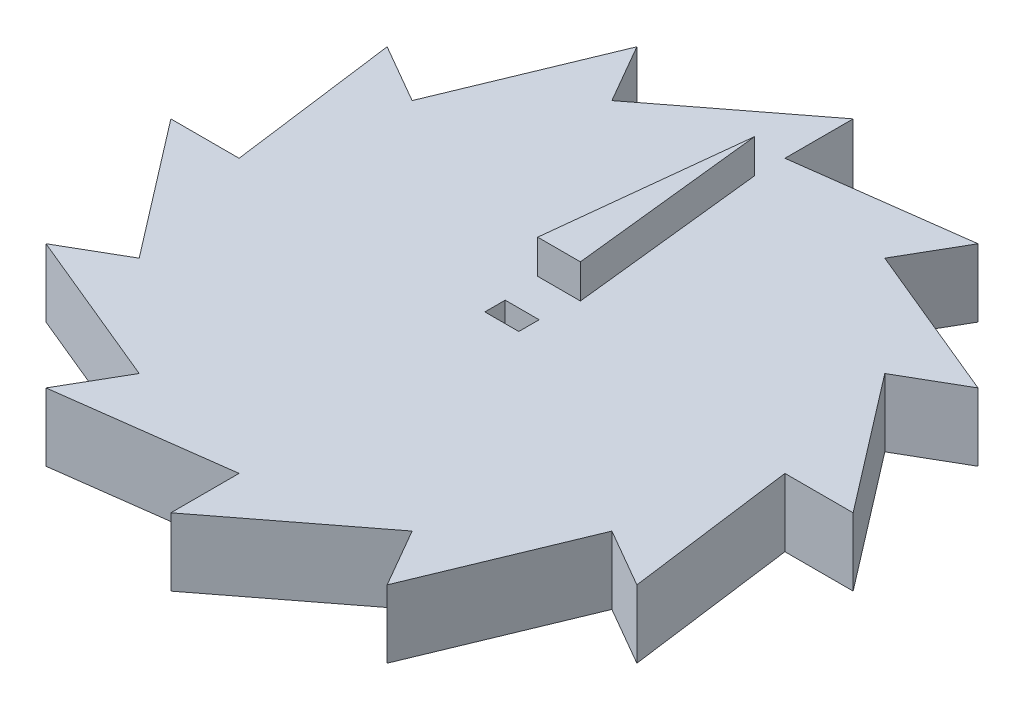
ISO-10303-21;
HEADER;
FILE_DESCRIPTION(('STEP AP214'),'2;1');
FILE_NAME('part.step','',(''),(''),'','','');
FILE_SCHEMA(('AUTOMOTIVE_DESIGN { 1 0 10303 214 1 1 1 1 }'));
ENDSEC;
DATA;
#1=APPLICATION_CONTEXT('core data for automotive mechanical design processes');
#2=APPLICATION_PROTOCOL_DEFINITION('international standard','automotive_design',2000,#1);
#3=PRODUCT_CONTEXT('',#1,'mechanical');
#4=PRODUCT('Part','Part','',(#3));
#5=PRODUCT_RELATED_PRODUCT_CATEGORY('part','',(#4));
#6=PRODUCT_DEFINITION_FORMATION('','',#4);
#7=PRODUCT_DEFINITION_CONTEXT('part definition',#1,'design');
#8=PRODUCT_DEFINITION('design','',#6,#7);
#9=PRODUCT_DEFINITION_SHAPE('','',#8);
#10=(LENGTH_UNIT() NAMED_UNIT(*) SI_UNIT(.MILLI.,.METRE.));
#11=(NAMED_UNIT(*) PLANE_ANGLE_UNIT() SI_UNIT($,.RADIAN.));
#12=(NAMED_UNIT(*) SI_UNIT($,.STERADIAN.) SOLID_ANGLE_UNIT());
#13=UNCERTAINTY_MEASURE_WITH_UNIT(LENGTH_MEASURE(1.E-05),#10,'distance_accuracy_value','');
#14=(GEOMETRIC_REPRESENTATION_CONTEXT(3) GLOBAL_UNCERTAINTY_ASSIGNED_CONTEXT((#13)) GLOBAL_UNIT_ASSIGNED_CONTEXT((#10,
#11,#12)) REPRESENTATION_CONTEXT('',''));
#15=CARTESIAN_POINT('',(0.,0.,0.));
#16=DIRECTION('',(0.,0.,1.));
#17=DIRECTION('',(1.,0.,0.));
#18=AXIS2_PLACEMENT_3D('',#15,#16,#17);
#19=CARTESIAN_POINT('',(0.,10.,0.));
#20=DIRECTION('',(0.,1.,0.));
#21=DIRECTION('',(0.,0.,1.));
#22=AXIS2_PLACEMENT_3D('',#19,#20,#21);
#23=PLANE('',#22);
#24=DIRECTION('',(1.,0.,0.));
#25=VECTOR('',#24,1.);
#26=CARTESIAN_POINT('',(-2.5,10.,1.5));
#27=LINE('',#26,#25);
#28=CARTESIAN_POINT('',(-2.5,10.,1.5));
#29=VERTEX_POINT('',#28);
#30=CARTESIAN_POINT('',(2.5,10.,1.5));
#31=VERTEX_POINT('',#30);
#32=EDGE_CURVE('E267',#29,#31,#27,.T.);
#33=ORIENTED_EDGE('',*,*,#32,.F.);
#34=DIRECTION('',(0.,0.,1.));
#35=VECTOR('',#34,1.);
#36=CARTESIAN_POINT('',(-2.5,10.,-1.5));
#37=LINE('',#36,#35);
#38=CARTESIAN_POINT('',(-2.5,10.,-1.5));
#39=VERTEX_POINT('',#38);
#40=EDGE_CURVE('E265',#39,#29,#37,.T.);
#41=ORIENTED_EDGE('',*,*,#40,.F.);
#42=DIRECTION('',(-1.,0.,0.));
#43=VECTOR('',#42,1.);
#44=CARTESIAN_POINT('',(-2.5,10.,-1.5));
#45=LINE('',#44,#43);
#46=CARTESIAN_POINT('',(2.5,10.,-1.5));
#47=VERTEX_POINT('',#46);
#48=EDGE_CURVE('E272',#47,#39,#45,.T.);
#49=ORIENTED_EDGE('',*,*,#48,.F.);
#50=DIRECTION('',(0.,0.,-1.));
#51=VECTOR('',#50,1.);
#52=CARTESIAN_POINT('',(2.5,10.,-1.5));
#53=LINE('',#52,#51);
#54=EDGE_CURVE('E270',#31,#47,#53,.T.);
#55=ORIENTED_EDGE('',*,*,#54,.F.);
#56=EDGE_LOOP('',(#33,#41,#49,#55));
#57=FACE_BOUND('',#56,.T.);
#58=DIRECTION('',(-0.991393683900797,0.,0.130914336577806));
#59=VECTOR('',#58,1.);
#60=CARTESIAN_POINT('',(25.1396416291331,10.,-43.5431365857308));
#61=LINE('',#60,#59);
#62=CARTESIAN_POINT('',(25.1396416291331,10.,-43.5431365857308));
#63=VERTEX_POINT('',#62);
#64=CARTESIAN_POINT('',(0.,10.,-40.223426606611));
#65=VERTEX_POINT('',#64);
#66=EDGE_CURVE('E291',#63,#65,#61,.T.);
#67=ORIENTED_EDGE('',*,*,#66,.T.);
#68=DIRECTION('',(0.,0.,-1.));
#69=VECTOR('',#68,1.);
#70=CARTESIAN_POINT('',(0.,10.,-40.223426606611));
#71=LINE('',#70,#69);
#72=CARTESIAN_POINT('',(0.,10.,-50.2792832582638));
#73=VERTEX_POINT('',#72);
#74=EDGE_CURVE('E294',#65,#73,#71,.T.);
#75=ORIENTED_EDGE('',*,*,#74,.T.);
#76=DIRECTION('',(-0.793114947120626,0.,0.609071983146365));
#77=VECTOR('',#76,1.);
#78=CARTESIAN_POINT('',(0.,10.,-50.2792832582638));
#79=LINE('',#78,#77);
#80=CARTESIAN_POINT('',(-20.1117133033062,10.,-34.8345092685828));
#81=VERTEX_POINT('',#80);
#82=EDGE_CURVE('E297',#73,#81,#79,.T.);
#83=ORIENTED_EDGE('',*,*,#82,.T.);
#84=DIRECTION('',(-0.5,0.,-0.866025403784438));
#85=VECTOR('',#84,1.);
#86=CARTESIAN_POINT('',(-20.1117133033062,10.,-34.8345092685828));
#87=LINE('',#86,#85);
#88=CARTESIAN_POINT('',(-25.1396416291326,10.,-43.5431365857288));
#89=VERTEX_POINT('',#88);
#90=EDGE_CURVE('E299',#81,#89,#87,.T.);
#91=ORIENTED_EDGE('',*,*,#90,.T.);
#92=DIRECTION('',(-0.382321700754425,0.,0.924029283698436));
#93=VECTOR('',#92,1.);
#94=CARTESIAN_POINT('',(-25.1396416291326,10.,-43.5431365857288));
#95=LINE('',#94,#93);
#96=CARTESIAN_POINT('',(-34.8345092685852,10.,-20.1117133033014));
#97=VERTEX_POINT('',#96);
#98=EDGE_CURVE('E301',#89,#97,#95,.T.);
#99=ORIENTED_EDGE('',*,*,#98,.T.);
#100=DIRECTION('',(-0.866025403784439,0.,-0.5));
#101=VECTOR('',#100,1.);
#102=CARTESIAN_POINT('',(-34.8345092685852,10.,-20.1117133033014));
#103=LINE('',#102,#101);
#104=CARTESIAN_POINT('',(-43.5431365857312,10.,-25.1396416291278));
#105=VERTEX_POINT('',#104);
#106=EDGE_CURVE('E303',#97,#105,#103,.T.);
#107=ORIENTED_EDGE('',*,*,#106,.T.);
#108=DIRECTION('',(0.130914336577818,0.,0.991393683900795));
#109=VECTOR('',#108,1.);
#110=CARTESIAN_POINT('',(-43.5431365857312,10.,-25.1396416291278));
#111=LINE('',#110,#109);
#112=CARTESIAN_POINT('',(-40.223426606611,10.,5.94927846668505E-12));
#113=VERTEX_POINT('',#112);
#114=EDGE_CURVE('E305',#105,#113,#111,.T.);
#115=ORIENTED_EDGE('',*,*,#114,.T.);
#116=DIRECTION('',(-1.,0.,0.));
#117=VECTOR('',#116,1.);
#118=CARTESIAN_POINT('',(-40.223426606611,10.,5.94927846668505E-12));
#119=LINE('',#118,#117);
#120=CARTESIAN_POINT('',(-50.2792832582638,10.,5.94927846668505E-12));
#121=VERTEX_POINT('',#120);
#122=EDGE_CURVE('E307',#113,#121,#119,.T.);
#123=ORIENTED_EDGE('',*,*,#122,.T.);
#124=DIRECTION('',(0.609071983146374,0.,0.793114947120619));
#125=VECTOR('',#124,1.);
#126=CARTESIAN_POINT('',(-50.2792832582638,10.,5.94927846668505E-12));
#127=LINE('',#126,#125);
#128=CARTESIAN_POINT('',(-34.8345092685822,10.,20.1117133033126));
#129=VERTEX_POINT('',#128);
#130=EDGE_CURVE('E309',#121,#129,#127,.T.);
#131=ORIENTED_EDGE('',*,*,#130,.T.);
#132=DIRECTION('',(-0.866025403784438,0.,0.500000000000001));
#133=VECTOR('',#132,1.);
#134=CARTESIAN_POINT('',(-34.8345092685822,10.,20.1117133033126));
#135=LINE('',#134,#133);
#136=CARTESIAN_POINT('',(-43.5431365857282,10.,25.1396416291389));
#137=VERTEX_POINT('',#136);
#138=EDGE_CURVE('E311',#129,#137,#135,.T.);
#139=ORIENTED_EDGE('',*,*,#138,.T.);
#140=DIRECTION('',(0.924029283698437,0.,0.382321700754421));
#141=VECTOR('',#140,1.);
#142=CARTESIAN_POINT('',(-43.5431365857282,10.,25.1396416291389));
#143=LINE('',#142,#141);
#144=CARTESIAN_POINT('',(-20.1117133033014,10.,34.8345092685911));
#145=VERTEX_POINT('',#144);
#146=EDGE_CURVE('E313',#137,#145,#143,.T.);
#147=ORIENTED_EDGE('',*,*,#146,.T.);
#148=DIRECTION('',(-0.499999999999999,0.,0.866025403784439));
#149=VECTOR('',#148,1.);
#150=CARTESIAN_POINT('',(-20.1117133033014,10.,34.8345092685911));
#151=LINE('',#150,#149);
#152=CARTESIAN_POINT('',(-25.1396416291278,10.,43.5431365857371));
#153=VERTEX_POINT('',#152);
#154=EDGE_CURVE('E315',#145,#153,#151,.T.);
#155=ORIENTED_EDGE('',*,*,#154,.T.);
#156=DIRECTION('',(0.991393683900795,0.,-0.130914336577818));
#157=VECTOR('',#156,1.);
#158=CARTESIAN_POINT('',(-25.1396416291278,10.,43.5431365857371));
#159=LINE('',#158,#157);
#160=CARTESIAN_POINT('',(5.9537931443947E-12,10.,40.223426606617));
#161=VERTEX_POINT('',#160);
#162=EDGE_CURVE('E317',#153,#161,#159,.T.);
#163=ORIENTED_EDGE('',*,*,#162,.T.);
#164=DIRECTION('',(0.,0.,1.));
#165=VECTOR('',#164,1.);
#166=CARTESIAN_POINT('',(5.9537931443947E-12,10.,40.223426606617));
#167=LINE('',#166,#165);
#168=CARTESIAN_POINT('',(5.95317740076164E-12,10.,50.2792832582697));
#169=VERTEX_POINT('',#168);
#170=EDGE_CURVE('E319',#161,#169,#167,.T.);
#171=ORIENTED_EDGE('',*,*,#170,.T.);
#172=DIRECTION('',(0.79311494712062,0.,-0.609071983146374));
#173=VECTOR('',#172,1.);
#174=CARTESIAN_POINT('',(5.95317740076164E-12,10.,50.2792832582697));
#175=LINE('',#174,#173);
#176=CARTESIAN_POINT('',(20.1117133033126,10.,34.8345092685881));
#177=VERTEX_POINT('',#176);
#178=EDGE_CURVE('E321',#169,#177,#175,.T.);
#179=ORIENTED_EDGE('',*,*,#178,.T.);
#180=DIRECTION('',(0.5,0.,0.866025403784438));
#181=VECTOR('',#180,1.);
#182=CARTESIAN_POINT('',(20.1117133033126,10.,34.8345092685881));
#183=LINE('',#182,#181);
#184=CARTESIAN_POINT('',(25.139641629139,10.,43.5431365857341));
#185=VERTEX_POINT('',#184);
#186=EDGE_CURVE('E323',#177,#185,#183,.T.);
#187=ORIENTED_EDGE('',*,*,#186,.T.);
#188=DIRECTION('',(0.382321700754421,0.,-0.924029283698437));
#189=VECTOR('',#188,1.);
#190=CARTESIAN_POINT('',(25.139641629139,10.,43.5431365857341));
#191=LINE('',#190,#189);
#192=CARTESIAN_POINT('',(34.8345092685911,10.,20.1117133033074));
#193=VERTEX_POINT('',#192);
#194=EDGE_CURVE('E325',#185,#193,#191,.T.);
#195=ORIENTED_EDGE('',*,*,#194,.T.);
#196=DIRECTION('',(0.866025403784439,0.,0.5));
#197=VECTOR('',#196,1.);
#198=CARTESIAN_POINT('',(34.8345092685911,10.,20.1117133033074));
#199=LINE('',#198,#197);
#200=CARTESIAN_POINT('',(43.5431365857371,10.,25.1396416291338));
#201=VERTEX_POINT('',#200);
#202=EDGE_CURVE('E327',#193,#201,#199,.T.);
#203=ORIENTED_EDGE('',*,*,#202,.T.);
#204=DIRECTION('',(-0.130914336577818,0.,-0.991393683900795));
#205=VECTOR('',#204,1.);
#206=CARTESIAN_POINT('',(43.5431365857371,10.,25.1396416291338));
#207=LINE('',#206,#205);
#208=CARTESIAN_POINT('',(40.223426606617,10.,0.));
#209=VERTEX_POINT('',#208);
#210=EDGE_CURVE('E329',#201,#209,#207,.T.);
#211=ORIENTED_EDGE('',*,*,#210,.T.);
#212=DIRECTION('',(1.,0.,0.));
#213=VECTOR('',#212,1.);
#214=CARTESIAN_POINT('',(40.223426606617,10.,0.));
#215=LINE('',#214,#213);
#216=CARTESIAN_POINT('',(50.2792832582698,10.,0.));
#217=VERTEX_POINT('',#216);
#218=EDGE_CURVE('E331',#209,#217,#215,.T.);
#219=ORIENTED_EDGE('',*,*,#218,.T.);
#220=DIRECTION('',(-0.609071983146374,0.,-0.79311494712062));
#221=VECTOR('',#220,1.);
#222=CARTESIAN_POINT('',(50.2792832582698,10.,0.));
#223=LINE('',#222,#221);
#224=CARTESIAN_POINT('',(34.8345092685881,10.,-20.1117133033066));
#225=VERTEX_POINT('',#224);
#226=EDGE_CURVE('E333',#217,#225,#223,.T.);
#227=ORIENTED_EDGE('',*,*,#226,.T.);
#228=DIRECTION('',(0.866025403784439,0.,-0.5));
#229=VECTOR('',#228,1.);
#230=CARTESIAN_POINT('',(34.8345092685881,10.,-20.1117133033066));
#231=LINE('',#230,#229);
#232=CARTESIAN_POINT('',(43.5431365857341,10.,-25.139641629133));
#233=VERTEX_POINT('',#232);
#234=EDGE_CURVE('E335',#225,#233,#231,.T.);
#235=ORIENTED_EDGE('',*,*,#234,.T.);
#236=DIRECTION('',(-0.924029283698446,0.,-0.382321700754399));
#237=VECTOR('',#236,1.);
#238=CARTESIAN_POINT('',(43.5431365857341,10.,-25.139641629133));
#239=LINE('',#238,#237);
#240=CARTESIAN_POINT('',(20.1117133033068,10.,-34.8345092685848));
#241=VERTEX_POINT('',#240);
#242=EDGE_CURVE('E337',#233,#241,#239,.T.);
#243=ORIENTED_EDGE('',*,*,#242,.T.);
#244=DIRECTION('',(0.5,0.,-0.866025403784439));
#245=VECTOR('',#244,1.);
#246=CARTESIAN_POINT('',(20.1117133033068,10.,-34.8345092685848));
#247=LINE('',#246,#245);
#248=EDGE_CURVE('E339',#241,#63,#247,.T.);
#249=ORIENTED_EDGE('',*,*,#248,.T.);
#250=EDGE_LOOP('',(#67,#75,#83,#91,#99,#107,#115,#123,#131,#139,#147,#155,#163,#171,#179,#187,
#195,#203,#211,#219,#227,#235,#243,#249));
#251=FACE_BOUND('',#250,.T.);
#252=DIRECTION('',(-0.108620689655172,0.,0.994083269036772));
#253=VECTOR('',#252,1.);
#254=CARTESIAN_POINT('',(0.,10.,-35.7618612088923));
#255=LINE('',#254,#253);
#256=CARTESIAN_POINT('',(0.,10.,-35.7618612088923));
#257=VERTEX_POINT('',#256);
#258=CARTESIAN_POINT('',(-3.15000000000001,10.,-6.93344640682597));
#259=VERTEX_POINT('',#258);
#260=EDGE_CURVE('E857',#257,#259,#255,.T.);
#261=ORIENTED_EDGE('',*,*,#260,.F.);
#262=DIRECTION('',(-0.108620689655173,0.,-0.994083269036772));
#263=VECTOR('',#262,1.);
#264=CARTESIAN_POINT('',(0.,10.,-35.7618612088923));
#265=LINE('',#264,#263);
#266=CARTESIAN_POINT('',(3.14999999999999,10.,-6.93344640682597));
#267=VERTEX_POINT('',#266);
#268=EDGE_CURVE('E254',#267,#257,#265,.T.);
#269=ORIENTED_EDGE('',*,*,#268,.F.);
#270=DIRECTION('',(1.,0.,0.));
#271=VECTOR('',#270,1.);
#272=CARTESIAN_POINT('',(3.14999999999999,10.,-6.93344640682597));
#273=LINE('',#272,#271);
#274=EDGE_CURVE('E250',#259,#267,#273,.T.);
#275=ORIENTED_EDGE('',*,*,#274,.F.);
#276=EDGE_LOOP('',(#261,#269,#275));
#277=FACE_BOUND('',#276,.T.);
#278=ADVANCED_FACE('F33',(#57,#251,#277),#23,.T.);
#279=CARTESIAN_POINT('',(0.,0.,0.));
#280=DIRECTION('',(0.,1.,0.));
#281=DIRECTION('',(0.,0.,1.));
#282=AXIS2_PLACEMENT_3D('',#279,#280,#281);
#283=PLANE('',#282);
#284=DIRECTION('',(-0.991393683900797,0.,0.130914336577806));
#285=VECTOR('',#284,1.);
#286=CARTESIAN_POINT('',(25.1396416291331,0.,-43.5431365857308));
#287=LINE('',#286,#285);
#288=CARTESIAN_POINT('',(25.1396416291331,0.,-43.5431365857308));
#289=VERTEX_POINT('',#288);
#290=CARTESIAN_POINT('',(0.,0.,-40.223426606611));
#291=VERTEX_POINT('',#290);
#292=EDGE_CURVE('E290',#289,#291,#287,.T.);
#293=ORIENTED_EDGE('',*,*,#292,.F.);
#294=DIRECTION('',(0.5,0.,-0.866025403784439));
#295=VECTOR('',#294,1.);
#296=CARTESIAN_POINT('',(20.1117133033068,0.,-34.8345092685848));
#297=LINE('',#296,#295);
#298=CARTESIAN_POINT('',(20.1117133033068,0.,-34.8345092685848));
#299=VERTEX_POINT('',#298);
#300=EDGE_CURVE('E295',#299,#289,#297,.T.);
#301=ORIENTED_EDGE('',*,*,#300,.F.);
#302=DIRECTION('',(-0.924029283698446,0.,-0.382321700754399));
#303=VECTOR('',#302,1.);
#304=CARTESIAN_POINT('',(43.5431365857341,0.,-25.139641629133));
#305=LINE('',#304,#303);
#306=CARTESIAN_POINT('',(43.5431365857341,0.,-25.139641629133));
#307=VERTEX_POINT('',#306);
#308=EDGE_CURVE('E386',#307,#299,#305,.T.);
#309=ORIENTED_EDGE('',*,*,#308,.F.);
#310=DIRECTION('',(0.866025403784439,0.,-0.5));
#311=VECTOR('',#310,1.);
#312=CARTESIAN_POINT('',(34.8345092685881,0.,-20.1117133033066));
#313=LINE('',#312,#311);
#314=CARTESIAN_POINT('',(34.8345092685881,0.,-20.1117133033066));
#315=VERTEX_POINT('',#314);
#316=EDGE_CURVE('E384',#315,#307,#313,.T.);
#317=ORIENTED_EDGE('',*,*,#316,.F.);
#318=DIRECTION('',(-0.609071983146374,0.,-0.79311494712062));
#319=VECTOR('',#318,1.);
#320=CARTESIAN_POINT('',(50.2792832582698,0.,0.));
#321=LINE('',#320,#319);
#322=CARTESIAN_POINT('',(50.2792832582698,0.,0.));
#323=VERTEX_POINT('',#322);
#324=EDGE_CURVE('E382',#323,#315,#321,.T.);
#325=ORIENTED_EDGE('',*,*,#324,.F.);
#326=DIRECTION('',(1.,0.,0.));
#327=VECTOR('',#326,1.);
#328=CARTESIAN_POINT('',(40.223426606617,0.,0.));
#329=LINE('',#328,#327);
#330=CARTESIAN_POINT('',(40.223426606617,0.,0.));
#331=VERTEX_POINT('',#330);
#332=EDGE_CURVE('E380',#331,#323,#329,.T.);
#333=ORIENTED_EDGE('',*,*,#332,.F.);
#334=DIRECTION('',(-0.130914336577818,0.,-0.991393683900795));
#335=VECTOR('',#334,1.);
#336=CARTESIAN_POINT('',(43.5431365857371,0.,25.1396416291338));
#337=LINE('',#336,#335);
#338=CARTESIAN_POINT('',(43.5431365857371,0.,25.1396416291338));
#339=VERTEX_POINT('',#338);
#340=EDGE_CURVE('E378',#339,#331,#337,.T.);
#341=ORIENTED_EDGE('',*,*,#340,.F.);
#342=DIRECTION('',(0.866025403784439,0.,0.5));
#343=VECTOR('',#342,1.);
#344=CARTESIAN_POINT('',(34.8345092685911,0.,20.1117133033074));
#345=LINE('',#344,#343);
#346=CARTESIAN_POINT('',(34.8345092685911,0.,20.1117133033074));
#347=VERTEX_POINT('',#346);
#348=EDGE_CURVE('E376',#347,#339,#345,.T.);
#349=ORIENTED_EDGE('',*,*,#348,.F.);
#350=DIRECTION('',(0.382321700754421,0.,-0.924029283698437));
#351=VECTOR('',#350,1.);
#352=CARTESIAN_POINT('',(25.139641629139,0.,43.5431365857341));
#353=LINE('',#352,#351);
#354=CARTESIAN_POINT('',(25.139641629139,0.,43.5431365857341));
#355=VERTEX_POINT('',#354);
#356=EDGE_CURVE('E374',#355,#347,#353,.T.);
#357=ORIENTED_EDGE('',*,*,#356,.F.);
#358=DIRECTION('',(0.5,0.,0.866025403784438));
#359=VECTOR('',#358,1.);
#360=CARTESIAN_POINT('',(20.1117133033126,0.,34.8345092685881));
#361=LINE('',#360,#359);
#362=CARTESIAN_POINT('',(20.1117133033126,0.,34.8345092685881));
#363=VERTEX_POINT('',#362);
#364=EDGE_CURVE('E372',#363,#355,#361,.T.);
#365=ORIENTED_EDGE('',*,*,#364,.F.);
#366=DIRECTION('',(0.79311494712062,0.,-0.609071983146374));
#367=VECTOR('',#366,1.);
#368=CARTESIAN_POINT('',(5.95317740076164E-12,0.,50.2792832582697));
#369=LINE('',#368,#367);
#370=CARTESIAN_POINT('',(5.95317740076164E-12,0.,50.2792832582697));
#371=VERTEX_POINT('',#370);
#372=EDGE_CURVE('E370',#371,#363,#369,.T.);
#373=ORIENTED_EDGE('',*,*,#372,.F.);
#374=DIRECTION('',(0.,0.,1.));
#375=VECTOR('',#374,1.);
#376=CARTESIAN_POINT('',(5.9537931443947E-12,0.,40.223426606617));
#377=LINE('',#376,#375);
#378=CARTESIAN_POINT('',(5.9537931443947E-12,0.,40.223426606617));
#379=VERTEX_POINT('',#378);
#380=EDGE_CURVE('E368',#379,#371,#377,.T.);
#381=ORIENTED_EDGE('',*,*,#380,.F.);
#382=DIRECTION('',(0.991393683900795,0.,-0.130914336577818));
#383=VECTOR('',#382,1.);
#384=CARTESIAN_POINT('',(-25.1396416291278,0.,43.5431365857371));
#385=LINE('',#384,#383);
#386=CARTESIAN_POINT('',(-25.1396416291278,0.,43.5431365857371));
#387=VERTEX_POINT('',#386);
#388=EDGE_CURVE('E366',#387,#379,#385,.T.);
#389=ORIENTED_EDGE('',*,*,#388,.F.);
#390=DIRECTION('',(-0.499999999999999,0.,0.866025403784439));
#391=VECTOR('',#390,1.);
#392=CARTESIAN_POINT('',(-20.1117133033014,0.,34.8345092685911));
#393=LINE('',#392,#391);
#394=CARTESIAN_POINT('',(-20.1117133033014,0.,34.8345092685911));
#395=VERTEX_POINT('',#394);
#396=EDGE_CURVE('E364',#395,#387,#393,.T.);
#397=ORIENTED_EDGE('',*,*,#396,.F.);
#398=DIRECTION('',(0.924029283698437,0.,0.382321700754421));
#399=VECTOR('',#398,1.);
#400=CARTESIAN_POINT('',(-43.5431365857282,0.,25.1396416291389));
#401=LINE('',#400,#399);
#402=CARTESIAN_POINT('',(-43.5431365857282,0.,25.1396416291389));
#403=VERTEX_POINT('',#402);
#404=EDGE_CURVE('E362',#403,#395,#401,.T.);
#405=ORIENTED_EDGE('',*,*,#404,.F.);
#406=DIRECTION('',(-0.866025403784438,0.,0.500000000000001));
#407=VECTOR('',#406,1.);
#408=CARTESIAN_POINT('',(-34.8345092685822,0.,20.1117133033126));
#409=LINE('',#408,#407);
#410=CARTESIAN_POINT('',(-34.8345092685822,0.,20.1117133033126));
#411=VERTEX_POINT('',#410);
#412=EDGE_CURVE('E360',#411,#403,#409,.T.);
#413=ORIENTED_EDGE('',*,*,#412,.F.);
#414=DIRECTION('',(0.609071983146374,0.,0.793114947120619));
#415=VECTOR('',#414,1.);
#416=CARTESIAN_POINT('',(-50.2792832582638,0.,5.94927846668505E-12));
#417=LINE('',#416,#415);
#418=CARTESIAN_POINT('',(-50.2792832582638,0.,5.94927846668505E-12));
#419=VERTEX_POINT('',#418);
#420=EDGE_CURVE('E358',#419,#411,#417,.T.);
#421=ORIENTED_EDGE('',*,*,#420,.F.);
#422=DIRECTION('',(-1.,0.,0.));
#423=VECTOR('',#422,1.);
#424=CARTESIAN_POINT('',(-40.223426606611,0.,5.94927846668505E-12));
#425=LINE('',#424,#423);
#426=CARTESIAN_POINT('',(-40.223426606611,0.,5.94927846668505E-12));
#427=VERTEX_POINT('',#426);
#428=EDGE_CURVE('E356',#427,#419,#425,.T.);
#429=ORIENTED_EDGE('',*,*,#428,.F.);
#430=DIRECTION('',(0.130914336577818,0.,0.991393683900795));
#431=VECTOR('',#430,1.);
#432=CARTESIAN_POINT('',(-43.5431365857312,0.,-25.1396416291278));
#433=LINE('',#432,#431);
#434=CARTESIAN_POINT('',(-43.5431365857312,0.,-25.1396416291278));
#435=VERTEX_POINT('',#434);
#436=EDGE_CURVE('E354',#435,#427,#433,.T.);
#437=ORIENTED_EDGE('',*,*,#436,.F.);
#438=DIRECTION('',(-0.866025403784439,0.,-0.5));
#439=VECTOR('',#438,1.);
#440=CARTESIAN_POINT('',(-34.8345092685852,0.,-20.1117133033014));
#441=LINE('',#440,#439);
#442=CARTESIAN_POINT('',(-34.8345092685852,0.,-20.1117133033014));
#443=VERTEX_POINT('',#442);
#444=EDGE_CURVE('E352',#443,#435,#441,.T.);
#445=ORIENTED_EDGE('',*,*,#444,.F.);
#446=DIRECTION('',(-0.382321700754425,0.,0.924029283698436));
#447=VECTOR('',#446,1.);
#448=CARTESIAN_POINT('',(-25.1396416291326,0.,-43.5431365857288));
#449=LINE('',#448,#447);
#450=CARTESIAN_POINT('',(-25.1396416291326,0.,-43.5431365857288));
#451=VERTEX_POINT('',#450);
#452=EDGE_CURVE('E350',#451,#443,#449,.T.);
#453=ORIENTED_EDGE('',*,*,#452,.F.);
#454=DIRECTION('',(-0.5,0.,-0.866025403784438));
#455=VECTOR('',#454,1.);
#456=CARTESIAN_POINT('',(-20.1117133033062,0.,-34.8345092685828));
#457=LINE('',#456,#455);
#458=CARTESIAN_POINT('',(-20.1117133033062,0.,-34.8345092685828));
#459=VERTEX_POINT('',#458);
#460=EDGE_CURVE('E348',#459,#451,#457,.T.);
#461=ORIENTED_EDGE('',*,*,#460,.F.);
#462=DIRECTION('',(-0.793114947120626,0.,0.609071983146365));
#463=VECTOR('',#462,1.);
#464=CARTESIAN_POINT('',(0.,0.,-50.2792832582638));
#465=LINE('',#464,#463);
#466=CARTESIAN_POINT('',(0.,0.,-50.2792832582638));
#467=VERTEX_POINT('',#466);
#468=EDGE_CURVE('E346',#467,#459,#465,.T.);
#469=ORIENTED_EDGE('',*,*,#468,.F.);
#470=DIRECTION('',(0.,0.,-1.));
#471=VECTOR('',#470,1.);
#472=CARTESIAN_POINT('',(0.,0.,-40.223426606611));
#473=LINE('',#472,#471);
#474=EDGE_CURVE('E344',#291,#467,#473,.T.);
#475=ORIENTED_EDGE('',*,*,#474,.F.);
#476=EDGE_LOOP('',(#293,#301,#309,#317,#325,#333,#341,#349,#357,#365,#373,#381,#389,#397,#405,
#413,#421,#429,#437,#445,#453,#461,#469,#475));
#477=FACE_BOUND('',#476,.T.);
#478=DIRECTION('',(0.,0.,1.));
#479=VECTOR('',#478,1.);
#480=CARTESIAN_POINT('',(-2.5,0.,-1.5));
#481=LINE('',#480,#479);
#482=CARTESIAN_POINT('',(-2.5,0.,-1.5));
#483=VERTEX_POINT('',#482);
#484=CARTESIAN_POINT('',(-2.5,0.,1.5));
#485=VERTEX_POINT('',#484);
#486=EDGE_CURVE('E256',#483,#485,#481,.T.);
#487=ORIENTED_EDGE('',*,*,#486,.T.);
#488=DIRECTION('',(1.,0.,0.));
#489=VECTOR('',#488,1.);
#490=CARTESIAN_POINT('',(-2.5,0.,1.5));
#491=LINE('',#490,#489);
#492=CARTESIAN_POINT('',(2.5,0.,1.5));
#493=VERTEX_POINT('',#492);
#494=EDGE_CURVE('E259',#485,#493,#491,.T.);
#495=ORIENTED_EDGE('',*,*,#494,.T.);
#496=DIRECTION('',(0.,0.,-1.));
#497=VECTOR('',#496,1.);
#498=CARTESIAN_POINT('',(2.5,0.,-1.5));
#499=LINE('',#498,#497);
#500=CARTESIAN_POINT('',(2.5,0.,-1.5));
#501=VERTEX_POINT('',#500);
#502=EDGE_CURVE('E277',#493,#501,#499,.T.);
#503=ORIENTED_EDGE('',*,*,#502,.T.);
#504=DIRECTION('',(-1.,0.,0.));
#505=VECTOR('',#504,1.);
#506=CARTESIAN_POINT('',(-2.5,0.,-1.5));
#507=LINE('',#506,#505);
#508=EDGE_CURVE('E268',#501,#483,#507,.T.);
#509=ORIENTED_EDGE('',*,*,#508,.T.);
#510=EDGE_LOOP('',(#487,#495,#503,#509));
#511=FACE_BOUND('',#510,.T.);
#512=ADVANCED_FACE('F464',(#477,#511),#283,.F.);
#513=CARTESIAN_POINT('',(25.1396416291331,10.,-43.5431365857308));
#514=DIRECTION('',(0.130914336577806,0.,0.991393683900797));
#515=DIRECTION('',(0.991393683900797,0.,-0.130914336577806));
#516=AXIS2_PLACEMENT_3D('',#513,#514,#515);
#517=PLANE('',#516);
#518=ORIENTED_EDGE('',*,*,#292,.T.);
#519=DIRECTION('',(0.,-1.,0.));
#520=VECTOR('',#519,1.);
#521=CARTESIAN_POINT('',(0.,10.,-40.223426606611));
#522=LINE('',#521,#520);
#523=EDGE_CURVE('E11',#65,#291,#522,.T.);
#524=ORIENTED_EDGE('',*,*,#523,.F.);
#525=ORIENTED_EDGE('',*,*,#66,.F.);
#526=DIRECTION('',(0.,-1.,0.));
#527=VECTOR('',#526,1.);
#528=CARTESIAN_POINT('',(25.1396416291331,10.,-43.5431365857308));
#529=LINE('',#528,#527);
#530=EDGE_CURVE('E341',#63,#289,#529,.T.);
#531=ORIENTED_EDGE('',*,*,#530,.T.);
#532=EDGE_LOOP('',(#518,#524,#525,#531));
#533=FACE_BOUND('',#532,.T.);
#534=ADVANCED_FACE('F35',(#533),#517,.F.);
#535=CARTESIAN_POINT('',(0.,10.,-40.223426606611));
#536=DIRECTION('',(-1.,0.,0.));
#537=DIRECTION('',(0.,0.,1.));
#538=AXIS2_PLACEMENT_3D('',#535,#536,#537);
#539=PLANE('',#538);
#540=ORIENTED_EDGE('',*,*,#474,.T.);
#541=DIRECTION('',(0.,-1.,0.));
#542=VECTOR('',#541,1.);
#543=CARTESIAN_POINT('',(0.,10.,-50.2792832582638));
#544=LINE('',#543,#542);
#545=EDGE_CURVE('E41',#73,#467,#544,.T.);
#546=ORIENTED_EDGE('',*,*,#545,.F.);
#547=ORIENTED_EDGE('',*,*,#74,.F.);
#548=ORIENTED_EDGE('',*,*,#523,.T.);
#549=EDGE_LOOP('',(#540,#546,#547,#548));
#550=FACE_BOUND('',#549,.T.);
#551=ADVANCED_FACE('F482',(#550),#539,.F.);
#552=CARTESIAN_POINT('',(0.,10.,-50.2792832582638));
#553=DIRECTION('',(0.609071983146365,0.,0.793114947120626));
#554=DIRECTION('',(0.793114947120626,0.,-0.609071983146365));
#555=AXIS2_PLACEMENT_3D('',#552,#553,#554);
#556=PLANE('',#555);
#557=ORIENTED_EDGE('',*,*,#468,.T.);
#558=DIRECTION('',(0.,-1.,0.));
#559=VECTOR('',#558,1.);
#560=CARTESIAN_POINT('',(-20.1117133033062,10.,-34.8345092685828));
#561=LINE('',#560,#559);
#562=EDGE_CURVE('E451',#81,#459,#561,.T.);
#563=ORIENTED_EDGE('',*,*,#562,.F.);
#564=ORIENTED_EDGE('',*,*,#82,.F.);
#565=ORIENTED_EDGE('',*,*,#545,.T.);
#566=EDGE_LOOP('',(#557,#563,#564,#565));
#567=FACE_BOUND('',#566,.T.);
#568=ADVANCED_FACE('F458',(#567),#556,.F.);
#569=CARTESIAN_POINT('',(-20.1117133033062,10.,-34.8345092685828));
#570=DIRECTION('',(-0.866025403784438,0.,0.5));
#571=DIRECTION('',(0.5,0.,0.866025403784438));
#572=AXIS2_PLACEMENT_3D('',#569,#570,#571);
#573=PLANE('',#572);
#574=ORIENTED_EDGE('',*,*,#460,.T.);
#575=DIRECTION('',(0.,-1.,0.));
#576=VECTOR('',#575,1.);
#577=CARTESIAN_POINT('',(-25.1396416291326,10.,-43.5431365857288));
#578=LINE('',#577,#576);
#579=EDGE_CURVE('E448',#89,#451,#578,.T.);
#580=ORIENTED_EDGE('',*,*,#579,.F.);
#581=ORIENTED_EDGE('',*,*,#90,.F.);
#582=ORIENTED_EDGE('',*,*,#562,.T.);
#583=EDGE_LOOP('',(#574,#580,#581,#582));
#584=FACE_BOUND('',#583,.T.);
#585=ADVANCED_FACE('F470',(#584),#573,.F.);
#586=CARTESIAN_POINT('',(-25.1396416291326,10.,-43.5431365857288));
#587=DIRECTION('',(0.924029283698436,0.,0.382321700754425));
#588=DIRECTION('',(0.382321700754425,0.,-0.924029283698436));
#589=AXIS2_PLACEMENT_3D('',#586,#587,#588);
#590=PLANE('',#589);
#591=ORIENTED_EDGE('',*,*,#452,.T.);
#592=DIRECTION('',(0.,-1.,0.));
#593=VECTOR('',#592,1.);
#594=CARTESIAN_POINT('',(-34.8345092685852,10.,-20.1117133033014));
#595=LINE('',#594,#593);
#596=EDGE_CURVE('E445',#97,#443,#595,.T.);
#597=ORIENTED_EDGE('',*,*,#596,.F.);
#598=ORIENTED_EDGE('',*,*,#98,.F.);
#599=ORIENTED_EDGE('',*,*,#579,.T.);
#600=EDGE_LOOP('',(#591,#597,#598,#599));
#601=FACE_BOUND('',#600,.T.);
#602=ADVANCED_FACE('F474',(#601),#590,.F.);
#603=CARTESIAN_POINT('',(-34.8345092685852,10.,-20.1117133033014));
#604=DIRECTION('',(-0.5,0.,0.866025403784439));
#605=DIRECTION('',(0.866025403784439,0.,0.5));
#606=AXIS2_PLACEMENT_3D('',#603,#604,#605);
#607=PLANE('',#606);
#608=ORIENTED_EDGE('',*,*,#444,.T.);
#609=DIRECTION('',(0.,-1.,0.));
#610=VECTOR('',#609,1.);
#611=CARTESIAN_POINT('',(-43.5431365857312,10.,-25.1396416291278));
#612=LINE('',#611,#610);
#613=EDGE_CURVE('E442',#105,#435,#612,.T.);
#614=ORIENTED_EDGE('',*,*,#613,.F.);
#615=ORIENTED_EDGE('',*,*,#106,.F.);
#616=ORIENTED_EDGE('',*,*,#596,.T.);
#617=EDGE_LOOP('',(#608,#614,#615,#616));
#618=FACE_BOUND('',#617,.T.);
#619=ADVANCED_FACE('F575',(#618),#607,.F.);
#620=CARTESIAN_POINT('',(-43.5431365857312,10.,-25.1396416291278));
#621=DIRECTION('',(0.991393683900795,0.,-0.130914336577818));
#622=DIRECTION('',(-0.130914336577818,0.,-0.991393683900795));
#623=AXIS2_PLACEMENT_3D('',#620,#621,#622);
#624=PLANE('',#623);
#625=ORIENTED_EDGE('',*,*,#436,.T.);
#626=DIRECTION('',(0.,-1.,0.));
#627=VECTOR('',#626,1.);
#628=CARTESIAN_POINT('',(-40.223426606611,10.,5.94927846668505E-12));
#629=LINE('',#628,#627);
#630=EDGE_CURVE('E439',#113,#427,#629,.T.);
#631=ORIENTED_EDGE('',*,*,#630,.F.);
#632=ORIENTED_EDGE('',*,*,#114,.F.);
#633=ORIENTED_EDGE('',*,*,#613,.T.);
#634=EDGE_LOOP('',(#625,#631,#632,#633));
#635=FACE_BOUND('',#634,.T.);
#636=ADVANCED_FACE('F573',(#635),#624,.F.);
#637=CARTESIAN_POINT('',(-40.223426606611,10.,5.94927846668505E-12));
#638=DIRECTION('',(0.,0.,1.));
#639=DIRECTION('',(1.,0.,0.));
#640=AXIS2_PLACEMENT_3D('',#637,#638,#639);
#641=PLANE('',#640);
#642=ORIENTED_EDGE('',*,*,#428,.T.);
#643=DIRECTION('',(0.,-1.,0.));
#644=VECTOR('',#643,1.);
#645=CARTESIAN_POINT('',(-50.2792832582638,10.,5.94927846668505E-12));
#646=LINE('',#645,#644);
#647=EDGE_CURVE('E436',#121,#419,#646,.T.);
#648=ORIENTED_EDGE('',*,*,#647,.F.);
#649=ORIENTED_EDGE('',*,*,#122,.F.);
#650=ORIENTED_EDGE('',*,*,#630,.T.);
#651=EDGE_LOOP('',(#642,#648,#649,#650));
#652=FACE_BOUND('',#651,.T.);
#653=ADVANCED_FACE('F569',(#652),#641,.F.);
#654=CARTESIAN_POINT('',(-50.2792832582638,10.,5.94927846668505E-12));
#655=DIRECTION('',(0.793114947120619,0.,-0.609071983146374));
#656=DIRECTION('',(-0.609071983146374,0.,-0.79311494712062));
#657=AXIS2_PLACEMENT_3D('',#654,#655,#656);
#658=PLANE('',#657);
#659=ORIENTED_EDGE('',*,*,#420,.T.);
#660=DIRECTION('',(0.,-1.,0.));
#661=VECTOR('',#660,1.);
#662=CARTESIAN_POINT('',(-34.8345092685822,10.,20.1117133033126));
#663=LINE('',#662,#661);
#664=EDGE_CURVE('E433',#129,#411,#663,.T.);
#665=ORIENTED_EDGE('',*,*,#664,.F.);
#666=ORIENTED_EDGE('',*,*,#130,.F.);
#667=ORIENTED_EDGE('',*,*,#647,.T.);
#668=EDGE_LOOP('',(#659,#665,#666,#667));
#669=FACE_BOUND('',#668,.T.);
#670=ADVANCED_FACE('F564',(#669),#658,.F.);
#671=CARTESIAN_POINT('',(-34.8345092685822,10.,20.1117133033126));
#672=DIRECTION('',(0.500000000000001,0.,0.866025403784438));
#673=DIRECTION('',(0.866025403784438,0.,-0.500000000000001));
#674=AXIS2_PLACEMENT_3D('',#671,#672,#673);
#675=PLANE('',#674);
#676=ORIENTED_EDGE('',*,*,#412,.T.);
#677=DIRECTION('',(0.,-1.,0.));
#678=VECTOR('',#677,1.);
#679=CARTESIAN_POINT('',(-43.5431365857282,10.,25.1396416291389));
#680=LINE('',#679,#678);
#681=EDGE_CURVE('E430',#137,#403,#680,.T.);
#682=ORIENTED_EDGE('',*,*,#681,.F.);
#683=ORIENTED_EDGE('',*,*,#138,.F.);
#684=ORIENTED_EDGE('',*,*,#664,.T.);
#685=EDGE_LOOP('',(#676,#682,#683,#684));
#686=FACE_BOUND('',#685,.T.);
#687=ADVANCED_FACE('F558',(#686),#675,.F.);
#688=CARTESIAN_POINT('',(-43.5431365857282,10.,25.1396416291389));
#689=DIRECTION('',(0.382321700754421,0.,-0.924029283698437));
#690=DIRECTION('',(-0.924029283698437,0.,-0.382321700754421));
#691=AXIS2_PLACEMENT_3D('',#688,#689,#690);
#692=PLANE('',#691);
#693=ORIENTED_EDGE('',*,*,#404,.T.);
#694=DIRECTION('',(0.,-1.,0.));
#695=VECTOR('',#694,1.);
#696=CARTESIAN_POINT('',(-20.1117133033014,10.,34.8345092685911));
#697=LINE('',#696,#695);
#698=EDGE_CURVE('E427',#145,#395,#697,.T.);
#699=ORIENTED_EDGE('',*,*,#698,.F.);
#700=ORIENTED_EDGE('',*,*,#146,.F.);
#701=ORIENTED_EDGE('',*,*,#681,.T.);
#702=EDGE_LOOP('',(#693,#699,#700,#701));
#703=FACE_BOUND('',#702,.T.);
#704=ADVANCED_FACE('F554',(#703),#692,.F.);
#705=CARTESIAN_POINT('',(-20.1117133033014,10.,34.8345092685911));
#706=DIRECTION('',(0.866025403784439,0.,0.5));
#707=DIRECTION('',(0.5,0.,-0.866025403784439));
#708=AXIS2_PLACEMENT_3D('',#705,#706,#707);
#709=PLANE('',#708);
#710=ORIENTED_EDGE('',*,*,#396,.T.);
#711=DIRECTION('',(0.,-1.,0.));
#712=VECTOR('',#711,1.);
#713=CARTESIAN_POINT('',(-25.1396416291278,10.,43.5431365857371));
#714=LINE('',#713,#712);
#715=EDGE_CURVE('E424',#153,#387,#714,.T.);
#716=ORIENTED_EDGE('',*,*,#715,.F.);
#717=ORIENTED_EDGE('',*,*,#154,.F.);
#718=ORIENTED_EDGE('',*,*,#698,.T.);
#719=EDGE_LOOP('',(#710,#716,#717,#718));
#720=FACE_BOUND('',#719,.T.);
#721=ADVANCED_FACE('F549',(#720),#709,.F.);
#722=CARTESIAN_POINT('',(-25.1396416291278,10.,43.5431365857371));
#723=DIRECTION('',(-0.130914336577818,0.,-0.991393683900795));
#724=DIRECTION('',(-0.991393683900795,0.,0.130914336577818));
#725=AXIS2_PLACEMENT_3D('',#722,#723,#724);
#726=PLANE('',#725);
#727=ORIENTED_EDGE('',*,*,#388,.T.);
#728=DIRECTION('',(0.,-1.,0.));
#729=VECTOR('',#728,1.);
#730=CARTESIAN_POINT('',(5.9537931443947E-12,10.,40.223426606617));
#731=LINE('',#730,#729);
#732=EDGE_CURVE('E421',#161,#379,#731,.T.);
#733=ORIENTED_EDGE('',*,*,#732,.F.);
#734=ORIENTED_EDGE('',*,*,#162,.F.);
#735=ORIENTED_EDGE('',*,*,#715,.T.);
#736=EDGE_LOOP('',(#727,#733,#734,#735));
#737=FACE_BOUND('',#736,.T.);
#738=ADVANCED_FACE('F543',(#737),#726,.F.);
#739=CARTESIAN_POINT('',(5.9537931443947E-12,10.,40.223426606617));
#740=DIRECTION('',(1.,0.,0.));
#741=DIRECTION('',(0.,0.,-1.));
#742=AXIS2_PLACEMENT_3D('',#739,#740,#741);
#743=PLANE('',#742);
#744=ORIENTED_EDGE('',*,*,#380,.T.);
#745=DIRECTION('',(0.,-1.,0.));
#746=VECTOR('',#745,1.);
#747=CARTESIAN_POINT('',(5.95317740076164E-12,10.,50.2792832582697));
#748=LINE('',#747,#746);
#749=EDGE_CURVE('E418',#169,#371,#748,.T.);
#750=ORIENTED_EDGE('',*,*,#749,.F.);
#751=ORIENTED_EDGE('',*,*,#170,.F.);
#752=ORIENTED_EDGE('',*,*,#732,.T.);
#753=EDGE_LOOP('',(#744,#750,#751,#752));
#754=FACE_BOUND('',#753,.T.);
#755=ADVANCED_FACE('F539',(#754),#743,.F.);
#756=CARTESIAN_POINT('',(5.95317740076164E-12,10.,50.2792832582697));
#757=DIRECTION('',(-0.609071983146374,0.,-0.79311494712062));
#758=DIRECTION('',(-0.79311494712062,0.,0.609071983146374));
#759=AXIS2_PLACEMENT_3D('',#756,#757,#758);
#760=PLANE('',#759);
#761=ORIENTED_EDGE('',*,*,#372,.T.);
#762=DIRECTION('',(0.,-1.,0.));
#763=VECTOR('',#762,1.);
#764=CARTESIAN_POINT('',(20.1117133033126,10.,34.8345092685881));
#765=LINE('',#764,#763);
#766=EDGE_CURVE('E415',#177,#363,#765,.T.);
#767=ORIENTED_EDGE('',*,*,#766,.F.);
#768=ORIENTED_EDGE('',*,*,#178,.F.);
#769=ORIENTED_EDGE('',*,*,#749,.T.);
#770=EDGE_LOOP('',(#761,#767,#768,#769));
#771=FACE_BOUND('',#770,.T.);
#772=ADVANCED_FACE('F534',(#771),#760,.F.);
#773=CARTESIAN_POINT('',(20.1117133033126,10.,34.8345092685881));
#774=DIRECTION('',(0.866025403784438,0.,-0.5));
#775=DIRECTION('',(-0.5,0.,-0.866025403784438));
#776=AXIS2_PLACEMENT_3D('',#773,#774,#775);
#777=PLANE('',#776);
#778=ORIENTED_EDGE('',*,*,#364,.T.);
#779=DIRECTION('',(0.,-1.,0.));
#780=VECTOR('',#779,1.);
#781=CARTESIAN_POINT('',(25.139641629139,10.,43.5431365857341));
#782=LINE('',#781,#780);
#783=EDGE_CURVE('E412',#185,#355,#782,.T.);
#784=ORIENTED_EDGE('',*,*,#783,.F.);
#785=ORIENTED_EDGE('',*,*,#186,.F.);
#786=ORIENTED_EDGE('',*,*,#766,.T.);
#787=EDGE_LOOP('',(#778,#784,#785,#786));
#788=FACE_BOUND('',#787,.T.);
#789=ADVANCED_FACE('F528',(#788),#777,.F.);
#790=CARTESIAN_POINT('',(25.139641629139,10.,43.5431365857341));
#791=DIRECTION('',(-0.924029283698437,0.,-0.382321700754421));
#792=DIRECTION('',(-0.382321700754421,0.,0.924029283698437));
#793=AXIS2_PLACEMENT_3D('',#790,#791,#792);
#794=PLANE('',#793);
#795=ORIENTED_EDGE('',*,*,#356,.T.);
#796=DIRECTION('',(0.,-1.,0.));
#797=VECTOR('',#796,1.);
#798=CARTESIAN_POINT('',(34.8345092685911,10.,20.1117133033074));
#799=LINE('',#798,#797);
#800=EDGE_CURVE('E409',#193,#347,#799,.T.);
#801=ORIENTED_EDGE('',*,*,#800,.F.);
#802=ORIENTED_EDGE('',*,*,#194,.F.);
#803=ORIENTED_EDGE('',*,*,#783,.T.);
#804=EDGE_LOOP('',(#795,#801,#802,#803));
#805=FACE_BOUND('',#804,.T.);
#806=ADVANCED_FACE('F524',(#805),#794,.F.);
#807=CARTESIAN_POINT('',(34.8345092685911,10.,20.1117133033074));
#808=DIRECTION('',(0.5,0.,-0.866025403784439));
#809=DIRECTION('',(-0.866025403784439,0.,-0.5));
#810=AXIS2_PLACEMENT_3D('',#807,#808,#809);
#811=PLANE('',#810);
#812=ORIENTED_EDGE('',*,*,#348,.T.);
#813=DIRECTION('',(0.,-1.,0.));
#814=VECTOR('',#813,1.);
#815=CARTESIAN_POINT('',(43.5431365857371,10.,25.1396416291338));
#816=LINE('',#815,#814);
#817=EDGE_CURVE('E406',#201,#339,#816,.T.);
#818=ORIENTED_EDGE('',*,*,#817,.F.);
#819=ORIENTED_EDGE('',*,*,#202,.F.);
#820=ORIENTED_EDGE('',*,*,#800,.T.);
#821=EDGE_LOOP('',(#812,#818,#819,#820));
#822=FACE_BOUND('',#821,.T.);
#823=ADVANCED_FACE('F519',(#822),#811,.F.);
#824=CARTESIAN_POINT('',(43.5431365857371,10.,25.1396416291338));
#825=DIRECTION('',(-0.991393683900795,0.,0.130914336577818));
#826=DIRECTION('',(0.130914336577818,0.,0.991393683900795));
#827=AXIS2_PLACEMENT_3D('',#824,#825,#826);
#828=PLANE('',#827);
#829=ORIENTED_EDGE('',*,*,#340,.T.);
#830=DIRECTION('',(0.,-1.,0.));
#831=VECTOR('',#830,1.);
#832=CARTESIAN_POINT('',(40.223426606617,10.,0.));
#833=LINE('',#832,#831);
#834=EDGE_CURVE('E403',#209,#331,#833,.T.);
#835=ORIENTED_EDGE('',*,*,#834,.F.);
#836=ORIENTED_EDGE('',*,*,#210,.F.);
#837=ORIENTED_EDGE('',*,*,#817,.T.);
#838=EDGE_LOOP('',(#829,#835,#836,#837));
#839=FACE_BOUND('',#838,.T.);
#840=ADVANCED_FACE('F513',(#839),#828,.F.);
#841=CARTESIAN_POINT('',(40.223426606617,10.,0.));
#842=DIRECTION('',(0.,0.,-1.));
#843=DIRECTION('',(-1.,0.,0.));
#844=AXIS2_PLACEMENT_3D('',#841,#842,#843);
#845=PLANE('',#844);
#846=ORIENTED_EDGE('',*,*,#332,.T.);
#847=DIRECTION('',(0.,-1.,0.));
#848=VECTOR('',#847,1.);
#849=CARTESIAN_POINT('',(50.2792832582698,10.,0.));
#850=LINE('',#849,#848);
#851=EDGE_CURVE('E400',#217,#323,#850,.T.);
#852=ORIENTED_EDGE('',*,*,#851,.F.);
#853=ORIENTED_EDGE('',*,*,#218,.F.);
#854=ORIENTED_EDGE('',*,*,#834,.T.);
#855=EDGE_LOOP('',(#846,#852,#853,#854));
#856=FACE_BOUND('',#855,.T.);
#857=ADVANCED_FACE('F509',(#856),#845,.F.);
#858=CARTESIAN_POINT('',(50.2792832582698,10.,0.));
#859=DIRECTION('',(-0.79311494712062,0.,0.609071983146374));
#860=DIRECTION('',(0.609071983146374,0.,0.79311494712062));
#861=AXIS2_PLACEMENT_3D('',#858,#859,#860);
#862=PLANE('',#861);
#863=ORIENTED_EDGE('',*,*,#324,.T.);
#864=DIRECTION('',(0.,-1.,0.));
#865=VECTOR('',#864,1.);
#866=CARTESIAN_POINT('',(34.8345092685881,10.,-20.1117133033066));
#867=LINE('',#866,#865);
#868=EDGE_CURVE('E397',#225,#315,#867,.T.);
#869=ORIENTED_EDGE('',*,*,#868,.F.);
#870=ORIENTED_EDGE('',*,*,#226,.F.);
#871=ORIENTED_EDGE('',*,*,#851,.T.);
#872=EDGE_LOOP('',(#863,#869,#870,#871));
#873=FACE_BOUND('',#872,.T.);
#874=ADVANCED_FACE('F504',(#873),#862,.F.);
#875=CARTESIAN_POINT('',(34.8345092685881,10.,-20.1117133033066));
#876=DIRECTION('',(-0.5,0.,-0.866025403784439));
#877=DIRECTION('',(-0.866025403784439,0.,0.5));
#878=AXIS2_PLACEMENT_3D('',#875,#876,#877);
#879=PLANE('',#878);
#880=ORIENTED_EDGE('',*,*,#316,.T.);
#881=DIRECTION('',(0.,-1.,0.));
#882=VECTOR('',#881,1.);
#883=CARTESIAN_POINT('',(43.5431365857341,10.,-25.139641629133));
#884=LINE('',#883,#882);
#885=EDGE_CURVE('E394',#233,#307,#884,.T.);
#886=ORIENTED_EDGE('',*,*,#885,.F.);
#887=ORIENTED_EDGE('',*,*,#234,.F.);
#888=ORIENTED_EDGE('',*,*,#868,.T.);
#889=EDGE_LOOP('',(#880,#886,#887,#888));
#890=FACE_BOUND('',#889,.T.);
#891=ADVANCED_FACE('F498',(#890),#879,.F.);
#892=CARTESIAN_POINT('',(43.5431365857341,10.,-25.139641629133));
#893=DIRECTION('',(-0.382321700754399,0.,0.924029283698446));
#894=DIRECTION('',(0.924029283698446,0.,0.382321700754399));
#895=AXIS2_PLACEMENT_3D('',#892,#893,#894);
#896=PLANE('',#895);
#897=ORIENTED_EDGE('',*,*,#308,.T.);
#898=DIRECTION('',(0.,-1.,0.));
#899=VECTOR('',#898,1.);
#900=CARTESIAN_POINT('',(20.1117133033068,10.,-34.8345092685848));
#901=LINE('',#900,#899);
#902=EDGE_CURVE('E391',#241,#299,#901,.T.);
#903=ORIENTED_EDGE('',*,*,#902,.F.);
#904=ORIENTED_EDGE('',*,*,#242,.F.);
#905=ORIENTED_EDGE('',*,*,#885,.T.);
#906=EDGE_LOOP('',(#897,#903,#904,#905));
#907=FACE_BOUND('',#906,.T.);
#908=ADVANCED_FACE('F494',(#907),#896,.F.);
#909=CARTESIAN_POINT('',(20.1117133033068,10.,-34.8345092685848));
#910=DIRECTION('',(-0.866025403784439,0.,-0.5));
#911=DIRECTION('',(-0.5,0.,0.866025403784439));
#912=AXIS2_PLACEMENT_3D('',#909,#910,#911);
#913=PLANE('',#912);
#914=ORIENTED_EDGE('',*,*,#300,.T.);
#915=ORIENTED_EDGE('',*,*,#530,.F.);
#916=ORIENTED_EDGE('',*,*,#248,.F.);
#917=ORIENTED_EDGE('',*,*,#902,.T.);
#918=EDGE_LOOP('',(#914,#915,#916,#917));
#919=FACE_BOUND('',#918,.T.);
#920=ADVANCED_FACE('F489',(#919),#913,.F.);
#921=CARTESIAN_POINT('',(-2.5,10.,-1.5));
#922=DIRECTION('',(1.,0.,0.));
#923=DIRECTION('',(0.,0.,-1.));
#924=AXIS2_PLACEMENT_3D('',#921,#922,#923);
#925=PLANE('',#924);
#926=ORIENTED_EDGE('',*,*,#486,.F.);
#927=DIRECTION('',(0.,-1.,0.));
#928=VECTOR('',#927,1.);
#929=CARTESIAN_POINT('',(-2.5,10.,-1.5));
#930=LINE('',#929,#928);
#931=EDGE_CURVE('E273',#39,#483,#930,.T.);
#932=ORIENTED_EDGE('',*,*,#931,.F.);
#933=ORIENTED_EDGE('',*,*,#40,.T.);
#934=DIRECTION('',(0.,-1.,0.));
#935=VECTOR('',#934,1.);
#936=CARTESIAN_POINT('',(-2.5,10.,1.5));
#937=LINE('',#936,#935);
#938=EDGE_CURVE('E287',#29,#485,#937,.T.);
#939=ORIENTED_EDGE('',*,*,#938,.T.);
#940=EDGE_LOOP('',(#926,#932,#933,#939));
#941=FACE_BOUND('',#940,.T.);
#942=ADVANCED_FACE('F593',(#941),#925,.T.);
#943=CARTESIAN_POINT('',(-2.5,10.,1.5));
#944=DIRECTION('',(0.,0.,-1.));
#945=DIRECTION('',(-1.,0.,0.));
#946=AXIS2_PLACEMENT_3D('',#943,#944,#945);
#947=PLANE('',#946);
#948=ORIENTED_EDGE('',*,*,#494,.F.);
#949=ORIENTED_EDGE('',*,*,#938,.F.);
#950=ORIENTED_EDGE('',*,*,#32,.T.);
#951=DIRECTION('',(0.,-1.,0.));
#952=VECTOR('',#951,1.);
#953=CARTESIAN_POINT('',(2.5,10.,1.5));
#954=LINE('',#953,#952);
#955=EDGE_CURVE('E285',#31,#493,#954,.T.);
#956=ORIENTED_EDGE('',*,*,#955,.T.);
#957=EDGE_LOOP('',(#948,#949,#950,#956));
#958=FACE_BOUND('',#957,.T.);
#959=ADVANCED_FACE('F703',(#958),#947,.T.);
#960=CARTESIAN_POINT('',(2.5,10.,-1.5));
#961=DIRECTION('',(-1.,0.,0.));
#962=DIRECTION('',(0.,0.,1.));
#963=AXIS2_PLACEMENT_3D('',#960,#961,#962);
#964=PLANE('',#963);
#965=ORIENTED_EDGE('',*,*,#502,.F.);
#966=ORIENTED_EDGE('',*,*,#955,.F.);
#967=ORIENTED_EDGE('',*,*,#54,.T.);
#968=DIRECTION('',(0.,-1.,0.));
#969=VECTOR('',#968,1.);
#970=CARTESIAN_POINT('',(2.5,10.,-1.5));
#971=LINE('',#970,#969);
#972=EDGE_CURVE('E56',#47,#501,#971,.T.);
#973=ORIENTED_EDGE('',*,*,#972,.T.);
#974=EDGE_LOOP('',(#965,#966,#967,#973));
#975=FACE_BOUND('',#974,.T.);
#976=ADVANCED_FACE('F710',(#975),#964,.T.);
#977=CARTESIAN_POINT('',(-2.5,10.,-1.5));
#978=DIRECTION('',(0.,0.,1.));
#979=DIRECTION('',(1.,0.,0.));
#980=AXIS2_PLACEMENT_3D('',#977,#978,#979);
#981=PLANE('',#980);
#982=ORIENTED_EDGE('',*,*,#508,.F.);
#983=ORIENTED_EDGE('',*,*,#972,.F.);
#984=ORIENTED_EDGE('',*,*,#48,.T.);
#985=ORIENTED_EDGE('',*,*,#931,.T.);
#986=EDGE_LOOP('',(#982,#983,#984,#985));
#987=FACE_BOUND('',#986,.T.);
#988=ADVANCED_FACE('F717',(#987),#981,.T.);
#989=CARTESIAN_POINT('',(0.,15.,-35.7618612088923));
#990=DIRECTION('',(-0.994083269036772,0.,0.108620689655173));
#991=DIRECTION('',(0.108620689655173,0.,0.994083269036772));
#992=AXIS2_PLACEMENT_3D('',#989,#990,#991);
#993=PLANE('',#992);
#994=ORIENTED_EDGE('',*,*,#268,.T.);
#995=DIRECTION('',(0.,-1.,0.));
#996=VECTOR('',#995,1.);
#997=CARTESIAN_POINT('',(0.,15.,-35.7618612088923));
#998=LINE('',#997,#996);
#999=CARTESIAN_POINT('',(0.,15.,-35.7618612088923));
#1000=VERTEX_POINT('',#999);
#1001=EDGE_CURVE('E239',#1000,#257,#998,.T.);
#1002=ORIENTED_EDGE('',*,*,#1001,.F.);
#1003=DIRECTION('',(-0.108620689655173,0.,-0.994083269036772));
#1004=VECTOR('',#1003,1.);
#1005=CARTESIAN_POINT('',(0.,15.,-35.7618612088923));
#1006=LINE('',#1005,#1004);
#1007=CARTESIAN_POINT('',(3.14999999999999,15.,-6.93344640682597));
#1008=VERTEX_POINT('',#1007);
#1009=EDGE_CURVE('E243',#1008,#1000,#1006,.T.);
#1010=ORIENTED_EDGE('',*,*,#1009,.F.);
#1011=DIRECTION('',(0.,-1.,0.));
#1012=VECTOR('',#1011,1.);
#1013=CARTESIAN_POINT('',(3.14999999999999,15.,-6.93344640682597));
#1014=LINE('',#1013,#1012);
#1015=EDGE_CURVE('E261',#1008,#267,#1014,.T.);
#1016=ORIENTED_EDGE('',*,*,#1015,.T.);
#1017=EDGE_LOOP('',(#994,#1002,#1010,#1016));
#1018=FACE_BOUND('',#1017,.T.);
#1019=ADVANCED_FACE('F252',(#1018),#993,.F.);
#1020=CARTESIAN_POINT('',(0.,15.,-35.7618612088923));
#1021=DIRECTION('',(0.994083269036772,0.,0.108620689655172));
#1022=DIRECTION('',(0.108620689655172,0.,-0.994083269036772));
#1023=AXIS2_PLACEMENT_3D('',#1020,#1021,#1022);
#1024=PLANE('',#1023);
#1025=ORIENTED_EDGE('',*,*,#260,.T.);
#1026=DIRECTION('',(0.,-1.,0.));
#1027=VECTOR('',#1026,1.);
#1028=CARTESIAN_POINT('',(-3.15000000000001,15.,-6.93344640682597));
#1029=LINE('',#1028,#1027);
#1030=CARTESIAN_POINT('',(-3.15000000000001,15.,-6.93344640682597));
#1031=VERTEX_POINT('',#1030);
#1032=EDGE_CURVE('E48',#1031,#259,#1029,.T.);
#1033=ORIENTED_EDGE('',*,*,#1032,.F.);
#1034=DIRECTION('',(-0.108620689655172,0.,0.994083269036772));
#1035=VECTOR('',#1034,1.);
#1036=CARTESIAN_POINT('',(0.,15.,-35.7618612088923));
#1037=LINE('',#1036,#1035);
#1038=EDGE_CURVE('E235',#1000,#1031,#1037,.T.);
#1039=ORIENTED_EDGE('',*,*,#1038,.F.);
#1040=ORIENTED_EDGE('',*,*,#1001,.T.);
#1041=EDGE_LOOP('',(#1025,#1033,#1039,#1040));
#1042=FACE_BOUND('',#1041,.T.);
#1043=ADVANCED_FACE('F237',(#1042),#1024,.F.);
#1044=CARTESIAN_POINT('',(3.14999999999999,15.,-6.93344640682597));
#1045=DIRECTION('',(0.,0.,-1.));
#1046=DIRECTION('',(-1.,0.,0.));
#1047=AXIS2_PLACEMENT_3D('',#1044,#1045,#1046);
#1048=PLANE('',#1047);
#1049=ORIENTED_EDGE('',*,*,#274,.T.);
#1050=ORIENTED_EDGE('',*,*,#1015,.F.);
#1051=DIRECTION('',(1.,0.,0.));
#1052=VECTOR('',#1051,1.);
#1053=CARTESIAN_POINT('',(3.14999999999999,15.,-6.93344640682597));
#1054=LINE('',#1053,#1052);
#1055=EDGE_CURVE('E242',#1031,#1008,#1054,.T.);
#1056=ORIENTED_EDGE('',*,*,#1055,.F.);
#1057=ORIENTED_EDGE('',*,*,#1032,.T.);
#1058=EDGE_LOOP('',(#1049,#1050,#1056,#1057));
#1059=FACE_BOUND('',#1058,.T.);
#1060=ADVANCED_FACE('F737',(#1059),#1048,.F.);
#1061=CARTESIAN_POINT('',(0.,15.,0.));
#1062=DIRECTION('',(0.,-1.,0.));
#1063=DIRECTION('',(0.,0.,-1.));
#1064=AXIS2_PLACEMENT_3D('',#1061,#1062,#1063);
#1065=PLANE('',#1064);
#1066=ORIENTED_EDGE('',*,*,#1009,.T.);
#1067=ORIENTED_EDGE('',*,*,#1038,.T.);
#1068=ORIENTED_EDGE('',*,*,#1055,.T.);
#1069=EDGE_LOOP('',(#1066,#1067,#1068));
#1070=FACE_BOUND('',#1069,.T.);
#1071=ADVANCED_FACE('F246',(#1070),#1065,.F.);
#1072=CLOSED_SHELL('',(#278,#512,#534,#551,#568,#585,#602,#619,#636,#653,#670,#687,#704,#721,
#738,#755,#772,#789,#806,#823,#840,#857,#874,#891,#908,#920,#942,#959,#976,#988,#1019,#1043,
#1060,#1071));
#1073=MANIFOLD_SOLID_BREP('B2',#1072);
#1074=ADVANCED_BREP_SHAPE_REPRESENTATION('',(#18,#1073),#14);
#1075=SHAPE_DEFINITION_REPRESENTATION(#9,#1074);
ENDSEC;
END-ISO-10303-21;
